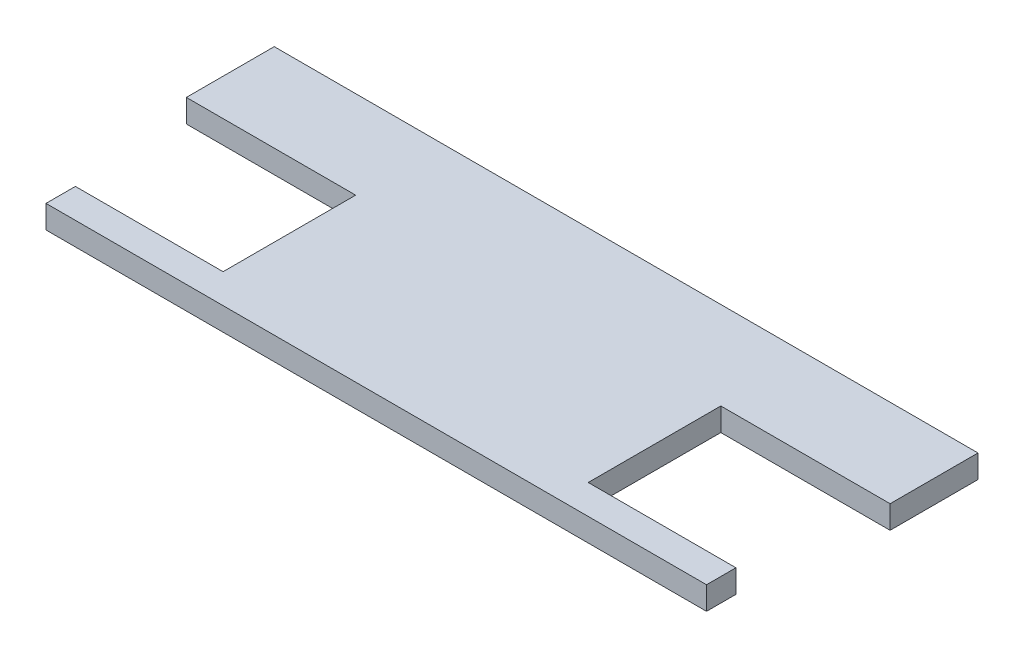
ISO-10303-21;
HEADER;
FILE_DESCRIPTION(('STEP AP214'),'2;1');
FILE_NAME('part.step','',(''),(''),'','','');
FILE_SCHEMA(('AUTOMOTIVE_DESIGN { 1 0 10303 214 1 1 1 1 }'));
ENDSEC;
DATA;
#1=APPLICATION_CONTEXT('core data for automotive mechanical design processes');
#2=APPLICATION_PROTOCOL_DEFINITION('international standard','automotive_design',2000,#1);
#3=PRODUCT_CONTEXT('',#1,'mechanical');
#4=PRODUCT('Part','Part','',(#3));
#5=PRODUCT_RELATED_PRODUCT_CATEGORY('part','',(#4));
#6=PRODUCT_DEFINITION_FORMATION('','',#4);
#7=PRODUCT_DEFINITION_CONTEXT('part definition',#1,'design');
#8=PRODUCT_DEFINITION('design','',#6,#7);
#9=PRODUCT_DEFINITION_SHAPE('','',#8);
#10=(LENGTH_UNIT() NAMED_UNIT(*) SI_UNIT(.MILLI.,.METRE.));
#11=(NAMED_UNIT(*) PLANE_ANGLE_UNIT() SI_UNIT($,.RADIAN.));
#12=(NAMED_UNIT(*) SI_UNIT($,.STERADIAN.) SOLID_ANGLE_UNIT());
#13=UNCERTAINTY_MEASURE_WITH_UNIT(LENGTH_MEASURE(1.E-05),#10,'distance_accuracy_value','');
#14=(GEOMETRIC_REPRESENTATION_CONTEXT(3) GLOBAL_UNCERTAINTY_ASSIGNED_CONTEXT((#13)) GLOBAL_UNIT_ASSIGNED_CONTEXT((#10,
#11,#12)) REPRESENTATION_CONTEXT('',''));
#15=CARTESIAN_POINT('',(0.,0.,0.));
#16=DIRECTION('',(0.,0.,1.));
#17=DIRECTION('',(1.,0.,0.));
#18=AXIS2_PLACEMENT_3D('',#15,#16,#17);
#19=CARTESIAN_POINT('',(0.,1.6,0.));
#20=DIRECTION('',(1.,0.,0.));
#21=DIRECTION('',(0.,0.,-1.));
#22=AXIS2_PLACEMENT_3D('',#19,#20,#21);
#23=PLANE('',#22);
#24=DIRECTION('',(0.,1.,0.));
#25=VECTOR('',#24,1.);
#26=CARTESIAN_POINT('',(0.,0.,-11.24));
#27=LINE('',#26,#25);
#28=CARTESIAN_POINT('',(0.,0.,-11.24));
#29=VERTEX_POINT('',#28);
#30=CARTESIAN_POINT('',(0.,1.6,-11.24));
#31=VERTEX_POINT('',#30);
#32=EDGE_CURVE('E56',#29,#31,#27,.T.);
#33=ORIENTED_EDGE('',*,*,#32,.T.);
#34=DIRECTION('',(0.,0.,1.));
#35=VECTOR('',#34,1.);
#36=CARTESIAN_POINT('',(0.,1.6,0.));
#37=LINE('',#36,#35);
#38=CARTESIAN_POINT('',(0.,1.6,-17.34));
#39=VERTEX_POINT('',#38);
#40=EDGE_CURVE('E195',#39,#31,#37,.T.);
#41=ORIENTED_EDGE('',*,*,#40,.F.);
#42=DIRECTION('',(0.,-1.,0.));
#43=VECTOR('',#42,1.);
#44=CARTESIAN_POINT('',(0.,1.6,-17.34));
#45=LINE('',#44,#43);
#46=CARTESIAN_POINT('',(0.,0.,-17.34));
#47=VERTEX_POINT('',#46);
#48=EDGE_CURVE('E41',#39,#47,#45,.T.);
#49=ORIENTED_EDGE('',*,*,#48,.T.);
#50=DIRECTION('',(0.,0.,1.));
#51=VECTOR('',#50,1.);
#52=CARTESIAN_POINT('',(0.,0.,0.));
#53=LINE('',#52,#51);
#54=EDGE_CURVE('E188',#47,#29,#53,.T.);
#55=ORIENTED_EDGE('',*,*,#54,.T.);
#56=EDGE_LOOP('',(#33,#41,#49,#55));
#57=FACE_BOUND('',#56,.T.);
#58=ADVANCED_FACE('F34',(#57),#23,.F.);
#59=CARTESIAN_POINT('',(0.,1.6,0.));
#60=DIRECTION('',(0.,0.,-1.));
#61=DIRECTION('',(-1.,0.,0.));
#62=AXIS2_PLACEMENT_3D('',#59,#60,#61);
#63=PLANE('',#62);
#64=DIRECTION('',(1.,0.,0.));
#65=VECTOR('',#64,1.);
#66=CARTESIAN_POINT('',(0.,0.,0.));
#67=LINE('',#66,#65);
#68=CARTESIAN_POINT('',(1.5,0.,0.));
#69=VERTEX_POINT('',#68);
#70=CARTESIAN_POINT('',(47.34,0.,0.));
#71=VERTEX_POINT('',#70);
#72=EDGE_CURVE('E208',#69,#71,#67,.T.);
#73=ORIENTED_EDGE('',*,*,#72,.T.);
#74=DIRECTION('',(0.,1.,0.));
#75=VECTOR('',#74,1.);
#76=CARTESIAN_POINT('',(47.34,0.,0.));
#77=LINE('',#76,#75);
#78=CARTESIAN_POINT('',(47.34,1.6,0.));
#79=VERTEX_POINT('',#78);
#80=EDGE_CURVE('E161',#71,#79,#77,.T.);
#81=ORIENTED_EDGE('',*,*,#80,.T.);
#82=DIRECTION('',(1.,0.,0.));
#83=VECTOR('',#82,1.);
#84=CARTESIAN_POINT('',(0.,1.6,0.));
#85=LINE('',#84,#83);
#86=CARTESIAN_POINT('',(1.5,1.6,0.));
#87=VERTEX_POINT('',#86);
#88=EDGE_CURVE('E198',#87,#79,#85,.T.);
#89=ORIENTED_EDGE('',*,*,#88,.F.);
#90=DIRECTION('',(0.,1.,0.));
#91=VECTOR('',#90,1.);
#92=CARTESIAN_POINT('',(1.5,0.,0.));
#93=LINE('',#92,#91);
#94=EDGE_CURVE('E191',#69,#87,#93,.T.);
#95=ORIENTED_EDGE('',*,*,#94,.F.);
#96=EDGE_LOOP('',(#73,#81,#89,#95));
#97=FACE_BOUND('',#96,.T.);
#98=ADVANCED_FACE('F243',(#97),#63,.F.);
#99=CARTESIAN_POINT('',(0.,1.6,0.));
#100=DIRECTION('',(0.,-1.,0.));
#101=DIRECTION('',(0.,0.,-1.));
#102=AXIS2_PLACEMENT_3D('',#99,#100,#101);
#103=PLANE('',#102);
#104=DIRECTION('',(0.,0.,1.));
#105=VECTOR('',#104,1.);
#106=CARTESIAN_POINT('',(37.09,1.6,0.));
#107=LINE('',#106,#105);
#108=CARTESIAN_POINT('',(37.09,1.6,-11.24));
#109=VERTEX_POINT('',#108);
#110=CARTESIAN_POINT('',(37.09,1.6,-2.04000000000001));
#111=VERTEX_POINT('',#110);
#112=EDGE_CURVE('E139',#109,#111,#107,.T.);
#113=ORIENTED_EDGE('',*,*,#112,.F.);
#114=DIRECTION('',(-1.,0.,0.));
#115=VECTOR('',#114,1.);
#116=CARTESIAN_POINT('',(48.84,1.6,-11.24));
#117=LINE('',#116,#115);
#118=CARTESIAN_POINT('',(48.84,1.6,-11.24));
#119=VERTEX_POINT('',#118);
#120=EDGE_CURVE('E144',#119,#109,#117,.T.);
#121=ORIENTED_EDGE('',*,*,#120,.F.);
#122=DIRECTION('',(0.,0.,-1.));
#123=VECTOR('',#122,1.);
#124=CARTESIAN_POINT('',(48.84,1.6,0.));
#125=LINE('',#124,#123);
#126=CARTESIAN_POINT('',(48.84,1.6,-17.34));
#127=VERTEX_POINT('',#126);
#128=EDGE_CURVE('E202',#119,#127,#125,.T.);
#129=ORIENTED_EDGE('',*,*,#128,.T.);
#130=DIRECTION('',(-1.,0.,0.));
#131=VECTOR('',#130,1.);
#132=CARTESIAN_POINT('',(0.,1.6,-17.34));
#133=LINE('',#132,#131);
#134=EDGE_CURVE('E204',#127,#39,#133,.T.);
#135=ORIENTED_EDGE('',*,*,#134,.T.);
#136=ORIENTED_EDGE('',*,*,#40,.T.);
#137=DIRECTION('',(1.,0.,0.));
#138=VECTOR('',#137,1.);
#139=CARTESIAN_POINT('',(0.,1.6,-11.24));
#140=LINE('',#139,#138);
#141=CARTESIAN_POINT('',(11.75,1.6,-11.24));
#142=VERTEX_POINT('',#141);
#143=EDGE_CURVE('E178',#31,#142,#140,.T.);
#144=ORIENTED_EDGE('',*,*,#143,.T.);
#145=DIRECTION('',(0.,0.,1.));
#146=VECTOR('',#145,1.);
#147=CARTESIAN_POINT('',(11.75,1.6,0.));
#148=LINE('',#147,#146);
#149=CARTESIAN_POINT('',(11.75,1.6,-2.04));
#150=VERTEX_POINT('',#149);
#151=EDGE_CURVE('E158',#142,#150,#148,.T.);
#152=ORIENTED_EDGE('',*,*,#151,.T.);
#153=DIRECTION('',(1.,0.,0.));
#154=VECTOR('',#153,1.);
#155=CARTESIAN_POINT('',(0.,1.6,-2.04));
#156=LINE('',#155,#154);
#157=CARTESIAN_POINT('',(1.5,1.6,-2.04));
#158=VERTEX_POINT('',#157);
#159=EDGE_CURVE('E168',#158,#150,#156,.T.);
#160=ORIENTED_EDGE('',*,*,#159,.F.);
#161=DIRECTION('',(0.,0.,1.));
#162=VECTOR('',#161,1.);
#163=CARTESIAN_POINT('',(1.5,1.6,0.));
#164=LINE('',#163,#162);
#165=EDGE_CURVE('E181',#158,#87,#164,.T.);
#166=ORIENTED_EDGE('',*,*,#165,.T.);
#167=ORIENTED_EDGE('',*,*,#88,.T.);
#168=DIRECTION('',(0.,0.,1.));
#169=VECTOR('',#168,1.);
#170=CARTESIAN_POINT('',(47.34,1.6,0.));
#171=LINE('',#170,#169);
#172=CARTESIAN_POINT('',(47.34,1.6,-2.04000000000001));
#173=VERTEX_POINT('',#172);
#174=EDGE_CURVE('E147',#173,#79,#171,.T.);
#175=ORIENTED_EDGE('',*,*,#174,.F.);
#176=DIRECTION('',(-1.,0.,0.));
#177=VECTOR('',#176,1.);
#178=CARTESIAN_POINT('',(48.84,1.6,-2.04000000000001));
#179=LINE('',#178,#177);
#180=EDGE_CURVE('E153',#173,#111,#179,.T.);
#181=ORIENTED_EDGE('',*,*,#180,.T.);
#182=EDGE_LOOP('',(#113,#121,#129,#135,#136,#144,#152,#160,#166,#167,#175,#181));
#183=FACE_BOUND('',#182,.T.);
#184=ADVANCED_FACE('F230',(#183),#103,.F.);
#185=CARTESIAN_POINT('',(0.,0.,0.));
#186=DIRECTION('',(0.,-1.,0.));
#187=DIRECTION('',(0.,0.,-1.));
#188=AXIS2_PLACEMENT_3D('',#185,#186,#187);
#189=PLANE('',#188);
#190=DIRECTION('',(-1.,0.,0.));
#191=VECTOR('',#190,1.);
#192=CARTESIAN_POINT('',(48.84,0.,-11.24));
#193=LINE('',#192,#191);
#194=CARTESIAN_POINT('',(48.84,0.,-11.24));
#195=VERTEX_POINT('',#194);
#196=CARTESIAN_POINT('',(37.09,0.,-11.24));
#197=VERTEX_POINT('',#196);
#198=EDGE_CURVE('E48',#195,#197,#193,.T.);
#199=ORIENTED_EDGE('',*,*,#198,.T.);
#200=DIRECTION('',(0.,0.,1.));
#201=VECTOR('',#200,1.);
#202=CARTESIAN_POINT('',(37.09,0.,0.));
#203=LINE('',#202,#201);
#204=CARTESIAN_POINT('',(37.09,0.,-2.04000000000001));
#205=VERTEX_POINT('',#204);
#206=EDGE_CURVE('E133',#197,#205,#203,.T.);
#207=ORIENTED_EDGE('',*,*,#206,.T.);
#208=DIRECTION('',(-1.,0.,0.));
#209=VECTOR('',#208,1.);
#210=CARTESIAN_POINT('',(48.84,0.,-2.04000000000001));
#211=LINE('',#210,#209);
#212=CARTESIAN_POINT('',(47.34,0.,-2.04000000000001));
#213=VERTEX_POINT('',#212);
#214=EDGE_CURVE('E121',#213,#205,#211,.T.);
#215=ORIENTED_EDGE('',*,*,#214,.F.);
#216=DIRECTION('',(0.,0.,1.));
#217=VECTOR('',#216,1.);
#218=CARTESIAN_POINT('',(47.34,0.,0.));
#219=LINE('',#218,#217);
#220=EDGE_CURVE('E132',#213,#71,#219,.T.);
#221=ORIENTED_EDGE('',*,*,#220,.T.);
#222=ORIENTED_EDGE('',*,*,#72,.F.);
#223=DIRECTION('',(0.,0.,1.));
#224=VECTOR('',#223,1.);
#225=CARTESIAN_POINT('',(1.5,0.,0.));
#226=LINE('',#225,#224);
#227=CARTESIAN_POINT('',(1.5,0.,-2.04));
#228=VERTEX_POINT('',#227);
#229=EDGE_CURVE('E170',#228,#69,#226,.T.);
#230=ORIENTED_EDGE('',*,*,#229,.F.);
#231=DIRECTION('',(1.,0.,0.));
#232=VECTOR('',#231,1.);
#233=CARTESIAN_POINT('',(0.,0.,-2.04));
#234=LINE('',#233,#232);
#235=CARTESIAN_POINT('',(11.75,0.,-2.04));
#236=VERTEX_POINT('',#235);
#237=EDGE_CURVE('E172',#228,#236,#234,.T.);
#238=ORIENTED_EDGE('',*,*,#237,.T.);
#239=DIRECTION('',(0.,0.,1.));
#240=VECTOR('',#239,1.);
#241=CARTESIAN_POINT('',(11.75,0.,0.));
#242=LINE('',#241,#240);
#243=CARTESIAN_POINT('',(11.75,0.,-11.24));
#244=VERTEX_POINT('',#243);
#245=EDGE_CURVE('E165',#244,#236,#242,.T.);
#246=ORIENTED_EDGE('',*,*,#245,.F.);
#247=DIRECTION('',(1.,0.,0.));
#248=VECTOR('',#247,1.);
#249=CARTESIAN_POINT('',(0.,0.,-11.24));
#250=LINE('',#249,#248);
#251=EDGE_CURVE('E167',#29,#244,#250,.T.);
#252=ORIENTED_EDGE('',*,*,#251,.F.);
#253=ORIENTED_EDGE('',*,*,#54,.F.);
#254=DIRECTION('',(-1.,0.,0.));
#255=VECTOR('',#254,1.);
#256=CARTESIAN_POINT('',(0.,0.,-17.34));
#257=LINE('',#256,#255);
#258=CARTESIAN_POINT('',(48.84,0.,-17.34));
#259=VERTEX_POINT('',#258);
#260=EDGE_CURVE('E199',#259,#47,#257,.T.);
#261=ORIENTED_EDGE('',*,*,#260,.F.);
#262=DIRECTION('',(0.,0.,-1.));
#263=VECTOR('',#262,1.);
#264=CARTESIAN_POINT('',(48.84,0.,0.));
#265=LINE('',#264,#263);
#266=EDGE_CURVE('E211',#195,#259,#265,.T.);
#267=ORIENTED_EDGE('',*,*,#266,.F.);
#268=EDGE_LOOP('',(#199,#207,#215,#221,#222,#230,#238,#246,#252,#253,#261,#267));
#269=FACE_BOUND('',#268,.T.);
#270=ADVANCED_FACE('F142',(#269),#189,.T.);
#271=CARTESIAN_POINT('',(48.84,1.6,0.));
#272=DIRECTION('',(-1.,0.,0.));
#273=DIRECTION('',(0.,0.,1.));
#274=AXIS2_PLACEMENT_3D('',#271,#272,#273);
#275=PLANE('',#274);
#276=ORIENTED_EDGE('',*,*,#128,.F.);
#277=DIRECTION('',(0.,1.,0.));
#278=VECTOR('',#277,1.);
#279=CARTESIAN_POINT('',(48.84,0.,-11.24));
#280=LINE('',#279,#278);
#281=EDGE_CURVE('E159',#195,#119,#280,.T.);
#282=ORIENTED_EDGE('',*,*,#281,.F.);
#283=ORIENTED_EDGE('',*,*,#266,.T.);
#284=DIRECTION('',(0.,-1.,0.));
#285=VECTOR('',#284,1.);
#286=CARTESIAN_POINT('',(48.84,1.6,-17.34));
#287=LINE('',#286,#285);
#288=EDGE_CURVE('E11',#127,#259,#287,.T.);
#289=ORIENTED_EDGE('',*,*,#288,.F.);
#290=EDGE_LOOP('',(#276,#282,#283,#289));
#291=FACE_BOUND('',#290,.T.);
#292=ADVANCED_FACE('F236',(#291),#275,.F.);
#293=CARTESIAN_POINT('',(0.,1.6,-17.34));
#294=DIRECTION('',(0.,0.,1.));
#295=DIRECTION('',(1.,0.,0.));
#296=AXIS2_PLACEMENT_3D('',#293,#294,#295);
#297=PLANE('',#296);
#298=ORIENTED_EDGE('',*,*,#260,.T.);
#299=ORIENTED_EDGE('',*,*,#48,.F.);
#300=ORIENTED_EDGE('',*,*,#134,.F.);
#301=ORIENTED_EDGE('',*,*,#288,.T.);
#302=EDGE_LOOP('',(#298,#299,#300,#301));
#303=FACE_BOUND('',#302,.T.);
#304=ADVANCED_FACE('F234',(#303),#297,.F.);
#305=CARTESIAN_POINT('',(11.75,0.,0.));
#306=DIRECTION('',(-1.,0.,0.));
#307=DIRECTION('',(0.,0.,1.));
#308=AXIS2_PLACEMENT_3D('',#305,#306,#307);
#309=PLANE('',#308);
#310=ORIENTED_EDGE('',*,*,#151,.F.);
#311=DIRECTION('',(0.,1.,0.));
#312=VECTOR('',#311,1.);
#313=CARTESIAN_POINT('',(11.75,0.,-11.24));
#314=LINE('',#313,#312);
#315=EDGE_CURVE('E175',#244,#142,#314,.T.);
#316=ORIENTED_EDGE('',*,*,#315,.F.);
#317=ORIENTED_EDGE('',*,*,#245,.T.);
#318=DIRECTION('',(0.,1.,0.));
#319=VECTOR('',#318,1.);
#320=CARTESIAN_POINT('',(11.75,0.,-2.04));
#321=LINE('',#320,#319);
#322=EDGE_CURVE('E186',#236,#150,#321,.T.);
#323=ORIENTED_EDGE('',*,*,#322,.T.);
#324=EDGE_LOOP('',(#310,#316,#317,#323));
#325=FACE_BOUND('',#324,.T.);
#326=ADVANCED_FACE('F226',(#325),#309,.T.);
#327=CARTESIAN_POINT('',(0.,0.,-2.04));
#328=DIRECTION('',(0.,0.,1.));
#329=DIRECTION('',(1.,0.,0.));
#330=AXIS2_PLACEMENT_3D('',#327,#328,#329);
#331=PLANE('',#330);
#332=ORIENTED_EDGE('',*,*,#159,.T.);
#333=ORIENTED_EDGE('',*,*,#322,.F.);
#334=ORIENTED_EDGE('',*,*,#237,.F.);
#335=DIRECTION('',(0.,1.,0.));
#336=VECTOR('',#335,1.);
#337=CARTESIAN_POINT('',(1.5,0.,-2.04));
#338=LINE('',#337,#336);
#339=EDGE_CURVE('E189',#228,#158,#338,.T.);
#340=ORIENTED_EDGE('',*,*,#339,.T.);
#341=EDGE_LOOP('',(#332,#333,#334,#340));
#342=FACE_BOUND('',#341,.T.);
#343=ADVANCED_FACE('F252',(#342),#331,.F.);
#344=CARTESIAN_POINT('',(1.5,0.,0.));
#345=DIRECTION('',(-1.,0.,0.));
#346=DIRECTION('',(0.,0.,1.));
#347=AXIS2_PLACEMENT_3D('',#344,#345,#346);
#348=PLANE('',#347);
#349=ORIENTED_EDGE('',*,*,#165,.F.);
#350=ORIENTED_EDGE('',*,*,#339,.F.);
#351=ORIENTED_EDGE('',*,*,#229,.T.);
#352=ORIENTED_EDGE('',*,*,#94,.T.);
#353=EDGE_LOOP('',(#349,#350,#351,#352));
#354=FACE_BOUND('',#353,.T.);
#355=ADVANCED_FACE('F250',(#354),#348,.T.);
#356=CARTESIAN_POINT('',(0.,0.,-11.24));
#357=DIRECTION('',(0.,0.,1.));
#358=DIRECTION('',(1.,0.,0.));
#359=AXIS2_PLACEMENT_3D('',#356,#357,#358);
#360=PLANE('',#359);
#361=ORIENTED_EDGE('',*,*,#143,.F.);
#362=ORIENTED_EDGE('',*,*,#32,.F.);
#363=ORIENTED_EDGE('',*,*,#251,.T.);
#364=ORIENTED_EDGE('',*,*,#315,.T.);
#365=EDGE_LOOP('',(#361,#362,#363,#364));
#366=FACE_BOUND('',#365,.T.);
#367=ADVANCED_FACE('F223',(#366),#360,.T.);
#368=CARTESIAN_POINT('',(37.09,0.,0.));
#369=DIRECTION('',(-1.,0.,0.));
#370=DIRECTION('',(0.,0.,1.));
#371=AXIS2_PLACEMENT_3D('',#368,#369,#370);
#372=PLANE('',#371);
#373=ORIENTED_EDGE('',*,*,#112,.T.);
#374=DIRECTION('',(0.,1.,0.));
#375=VECTOR('',#374,1.);
#376=CARTESIAN_POINT('',(37.09,0.,-2.04000000000001));
#377=LINE('',#376,#375);
#378=EDGE_CURVE('E125',#205,#111,#377,.T.);
#379=ORIENTED_EDGE('',*,*,#378,.F.);
#380=ORIENTED_EDGE('',*,*,#206,.F.);
#381=DIRECTION('',(0.,1.,0.));
#382=VECTOR('',#381,1.);
#383=CARTESIAN_POINT('',(37.09,0.,-11.24));
#384=LINE('',#383,#382);
#385=EDGE_CURVE('E156',#197,#109,#384,.T.);
#386=ORIENTED_EDGE('',*,*,#385,.T.);
#387=EDGE_LOOP('',(#373,#379,#380,#386));
#388=FACE_BOUND('',#387,.T.);
#389=ADVANCED_FACE('F137',(#388),#372,.F.);
#390=CARTESIAN_POINT('',(48.84,0.,-11.24));
#391=DIRECTION('',(0.,0.,-1.));
#392=DIRECTION('',(-1.,0.,0.));
#393=AXIS2_PLACEMENT_3D('',#390,#391,#392);
#394=PLANE('',#393);
#395=ORIENTED_EDGE('',*,*,#120,.T.);
#396=ORIENTED_EDGE('',*,*,#385,.F.);
#397=ORIENTED_EDGE('',*,*,#198,.F.);
#398=ORIENTED_EDGE('',*,*,#281,.T.);
#399=EDGE_LOOP('',(#395,#396,#397,#398));
#400=FACE_BOUND('',#399,.T.);
#401=ADVANCED_FACE('F237',(#400),#394,.F.);
#402=CARTESIAN_POINT('',(47.34,0.,0.));
#403=DIRECTION('',(-1.,0.,0.));
#404=DIRECTION('',(0.,0.,1.));
#405=AXIS2_PLACEMENT_3D('',#402,#403,#404);
#406=PLANE('',#405);
#407=ORIENTED_EDGE('',*,*,#174,.T.);
#408=ORIENTED_EDGE('',*,*,#80,.F.);
#409=ORIENTED_EDGE('',*,*,#220,.F.);
#410=DIRECTION('',(0.,1.,0.));
#411=VECTOR('',#410,1.);
#412=CARTESIAN_POINT('',(47.34,0.,-2.04000000000001));
#413=LINE('',#412,#411);
#414=EDGE_CURVE('E127',#213,#173,#413,.T.);
#415=ORIENTED_EDGE('',*,*,#414,.T.);
#416=EDGE_LOOP('',(#407,#408,#409,#415));
#417=FACE_BOUND('',#416,.T.);
#418=ADVANCED_FACE('F241',(#417),#406,.F.);
#419=CARTESIAN_POINT('',(48.84,0.,-2.04000000000001));
#420=DIRECTION('',(0.,0.,-1.));
#421=DIRECTION('',(-1.,0.,0.));
#422=AXIS2_PLACEMENT_3D('',#419,#420,#421);
#423=PLANE('',#422);
#424=ORIENTED_EDGE('',*,*,#180,.F.);
#425=ORIENTED_EDGE('',*,*,#414,.F.);
#426=ORIENTED_EDGE('',*,*,#214,.T.);
#427=ORIENTED_EDGE('',*,*,#378,.T.);
#428=EDGE_LOOP('',(#424,#425,#426,#427));
#429=FACE_BOUND('',#428,.T.);
#430=ADVANCED_FACE('F124',(#429),#423,.T.);
#431=CLOSED_SHELL('',(#58,#98,#184,#270,#292,#304,#326,#343,#355,#367,#389,#401,#418,#430));
#432=MANIFOLD_SOLID_BREP('B2',#431);
#433=ADVANCED_BREP_SHAPE_REPRESENTATION('',(#18,#432),#14);
#434=SHAPE_DEFINITION_REPRESENTATION(#9,#433);
ENDSEC;
END-ISO-10303-21;
